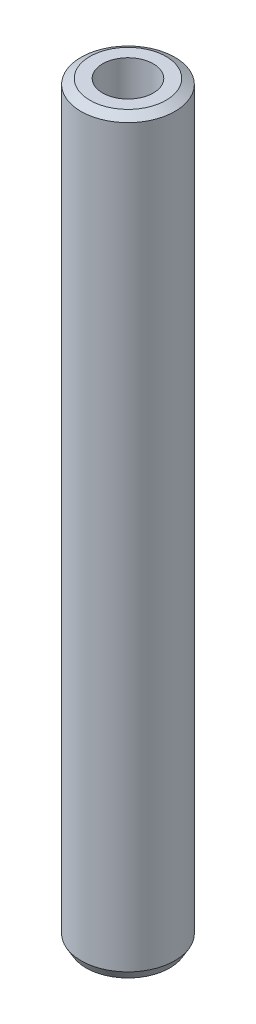
ISO-10303-21;
HEADER;
FILE_DESCRIPTION(('STEP AP214'),'2;1');
FILE_NAME('part.step','',(''),(''),'','','');
FILE_SCHEMA(('AUTOMOTIVE_DESIGN { 1 0 10303 214 1 1 1 1 }'));
ENDSEC;
DATA;
#1=APPLICATION_CONTEXT('core data for automotive mechanical design processes');
#2=APPLICATION_PROTOCOL_DEFINITION('international standard','automotive_design',2000,#1);
#3=PRODUCT_CONTEXT('',#1,'mechanical');
#4=PRODUCT('Part','Part','',(#3));
#5=PRODUCT_RELATED_PRODUCT_CATEGORY('part','',(#4));
#6=PRODUCT_DEFINITION_FORMATION('','',#4);
#7=PRODUCT_DEFINITION_CONTEXT('part definition',#1,'design');
#8=PRODUCT_DEFINITION('design','',#6,#7);
#9=PRODUCT_DEFINITION_SHAPE('','',#8);
#10=(LENGTH_UNIT() NAMED_UNIT(*) SI_UNIT(.MILLI.,.METRE.));
#11=(NAMED_UNIT(*) PLANE_ANGLE_UNIT() SI_UNIT($,.RADIAN.));
#12=(NAMED_UNIT(*) SI_UNIT($,.STERADIAN.) SOLID_ANGLE_UNIT());
#13=UNCERTAINTY_MEASURE_WITH_UNIT(LENGTH_MEASURE(1.E-05),#10,'distance_accuracy_value','');
#14=(GEOMETRIC_REPRESENTATION_CONTEXT(3) GLOBAL_UNCERTAINTY_ASSIGNED_CONTEXT((#13)) GLOBAL_UNIT_ASSIGNED_CONTEXT((#10,
#11,#12)) REPRESENTATION_CONTEXT('',''));
#15=CARTESIAN_POINT('',(0.,0.,0.));
#16=DIRECTION('',(0.,0.,1.));
#17=DIRECTION('',(1.,0.,0.));
#18=AXIS2_PLACEMENT_3D('',#15,#16,#17);
#19=CARTESIAN_POINT('',(0.,518.907687396923,0.));
#20=DIRECTION('',(0.,-1.,0.));
#21=DIRECTION('',(0.,0.,-1.));
#22=AXIS2_PLACEMENT_3D('',#19,#20,#21);
#23=CYLINDRICAL_SURFACE('',#22,32.5);
#24=CARTESIAN_POINT('',(0.,515.339217758141,0.));
#25=DIRECTION('',(0.,1.,0.));
#26=DIRECTION('',(0.,0.,1.));
#27=AXIS2_PLACEMENT_3D('',#24,#25,#26);
#28=CIRCLE('',#27,32.5);
#29=CARTESIAN_POINT('',(0.,515.339217758141,32.5));
#30=VERTEX_POINT('',#29);
#31=EDGE_CURVE('E50',#30,#30,#28,.F.);
#32=ORIENTED_EDGE('',*,*,#31,.T.);
#33=EDGE_LOOP('',(#32));
#34=FACE_BOUND('',#33,.T.);
#35=CARTESIAN_POINT('',(0.,6.18077071963785,0.));
#36=DIRECTION('',(0.,1.,0.));
#37=DIRECTION('',(0.,0.,1.));
#38=AXIS2_PLACEMENT_3D('',#35,#36,#37);
#39=CIRCLE('',#38,32.5);
#40=CARTESIAN_POINT('',(0.,6.18077071963785,32.5));
#41=VERTEX_POINT('',#40);
#42=EDGE_CURVE('E51',#41,#41,#39,.T.);
#43=ORIENTED_EDGE('',*,*,#42,.T.);
#44=EDGE_LOOP('',(#43));
#45=FACE_BOUND('',#44,.T.);
#46=ADVANCED_FACE('F39',(#34,#45),#23,.T.);
#47=CARTESIAN_POINT('',(0.,518.907687396923,0.));
#48=DIRECTION('',(0.,1.,0.));
#49=DIRECTION('',(0.,0.,1.));
#50=AXIS2_PLACEMENT_3D('',#47,#48,#49);
#51=PLANE('',#50);
#52=CARTESIAN_POINT('',(0.,518.907687396923,0.));
#53=DIRECTION('',(0.,1.,0.));
#54=DIRECTION('',(0.,0.,1.));
#55=AXIS2_PLACEMENT_3D('',#52,#53,#54);
#56=CIRCLE('',#55,26.319229280362);
#57=CARTESIAN_POINT('',(0.,518.907687396923,26.319229280362));
#58=VERTEX_POINT('',#57);
#59=EDGE_CURVE('E54',#58,#58,#56,.T.);
#60=ORIENTED_EDGE('',*,*,#59,.T.);
#61=EDGE_LOOP('',(#60));
#62=FACE_BOUND('',#61,.T.);
#63=CARTESIAN_POINT('',(0.,518.907687396923,0.));
#64=DIRECTION('',(0.,1.,0.));
#65=DIRECTION('',(0.,0.,1.));
#66=AXIS2_PLACEMENT_3D('',#63,#64,#65);
#67=CIRCLE('',#66,17.5397819223579);
#68=CARTESIAN_POINT('',(0.,518.907687396923,17.5397819223579));
#69=VERTEX_POINT('',#68);
#70=EDGE_CURVE('E58',#69,#69,#67,.T.);
#71=ORIENTED_EDGE('',*,*,#70,.F.);
#72=EDGE_LOOP('',(#71));
#73=FACE_BOUND('',#72,.T.);
#74=ADVANCED_FACE('F69',(#62,#73),#51,.T.);
#75=CARTESIAN_POINT('',(0.,0.,0.));
#76=DIRECTION('',(0.,1.,0.));
#77=DIRECTION('',(0.,0.,1.));
#78=AXIS2_PLACEMENT_3D('',#75,#76,#77);
#79=PLANE('',#78);
#80=CARTESIAN_POINT('',(0.,0.,0.));
#81=DIRECTION('',(0.,1.,0.));
#82=DIRECTION('',(0.,0.,1.));
#83=AXIS2_PLACEMENT_3D('',#80,#81,#82);
#84=CIRCLE('',#83,28.9315303612177);
#85=CARTESIAN_POINT('',(0.,0.,28.9315303612177));
#86=VERTEX_POINT('',#85);
#87=EDGE_CURVE('E10',#86,#86,#84,.F.);
#88=ORIENTED_EDGE('',*,*,#87,.T.);
#89=EDGE_LOOP('',(#88));
#90=FACE_BOUND('',#89,.T.);
#91=CARTESIAN_POINT('',(0.,0.,0.));
#92=DIRECTION('',(0.,1.,0.));
#93=DIRECTION('',(0.,0.,1.));
#94=AXIS2_PLACEMENT_3D('',#91,#92,#93);
#95=CIRCLE('',#94,17.5397819223579);
#96=CARTESIAN_POINT('',(0.,0.,17.5397819223579));
#97=VERTEX_POINT('',#96);
#98=EDGE_CURVE('E63',#97,#97,#95,.T.);
#99=ORIENTED_EDGE('',*,*,#98,.T.);
#100=EDGE_LOOP('',(#99));
#101=FACE_BOUND('',#100,.T.);
#102=ADVANCED_FACE('F75',(#90,#101),#79,.F.);
#103=CARTESIAN_POINT('',(0.,518.907687396923,0.));
#104=DIRECTION('',(0.,-1.,0.));
#105=DIRECTION('',(0.,0.,-1.));
#106=AXIS2_PLACEMENT_3D('',#103,#104,#105);
#107=CYLINDRICAL_SURFACE('',#106,17.5397819223579);
#108=ORIENTED_EDGE('',*,*,#70,.T.);
#109=EDGE_LOOP('',(#108));
#110=FACE_BOUND('',#109,.T.);
#111=ORIENTED_EDGE('',*,*,#98,.F.);
#112=EDGE_LOOP('',(#111));
#113=FACE_BOUND('',#112,.T.);
#114=ADVANCED_FACE('F70',(#110,#113),#107,.F.);
#115=CARTESIAN_POINT('',(0.,518.907687396923,0.));
#116=DIRECTION('',(0.,-1.,0.));
#117=DIRECTION('',(0.,0.,-1.));
#118=AXIS2_PLACEMENT_3D('',#115,#116,#117);
#119=CONICAL_SURFACE('',#118,26.319229280362,1.0471975511966);
#120=ORIENTED_EDGE('',*,*,#31,.F.);
#121=EDGE_LOOP('',(#120));
#122=FACE_BOUND('',#121,.T.);
#123=ORIENTED_EDGE('',*,*,#59,.F.);
#124=EDGE_LOOP('',(#123));
#125=FACE_BOUND('',#124,.T.);
#126=ADVANCED_FACE('F81',(#122,#125),#119,.T.);
#127=CARTESIAN_POINT('',(0.,6.18077071963785,0.));
#128=DIRECTION('',(0.,1.,0.));
#129=DIRECTION('',(0.,0.,1.));
#130=AXIS2_PLACEMENT_3D('',#127,#128,#129);
#131=CONICAL_SURFACE('',#130,32.5,0.523598775598302);
#132=ORIENTED_EDGE('',*,*,#87,.F.);
#133=EDGE_LOOP('',(#132));
#134=FACE_BOUND('',#133,.T.);
#135=ORIENTED_EDGE('',*,*,#42,.F.);
#136=EDGE_LOOP('',(#135));
#137=FACE_BOUND('',#136,.T.);
#138=ADVANCED_FACE('F45',(#134,#137),#131,.T.);
#139=CLOSED_SHELL('',(#46,#74,#102,#114,#126,#138));
#140=MANIFOLD_SOLID_BREP('B2',#139);
#141=ADVANCED_BREP_SHAPE_REPRESENTATION('',(#18,#140),#14);
#142=SHAPE_DEFINITION_REPRESENTATION(#9,#141);
ENDSEC;
END-ISO-10303-21;
